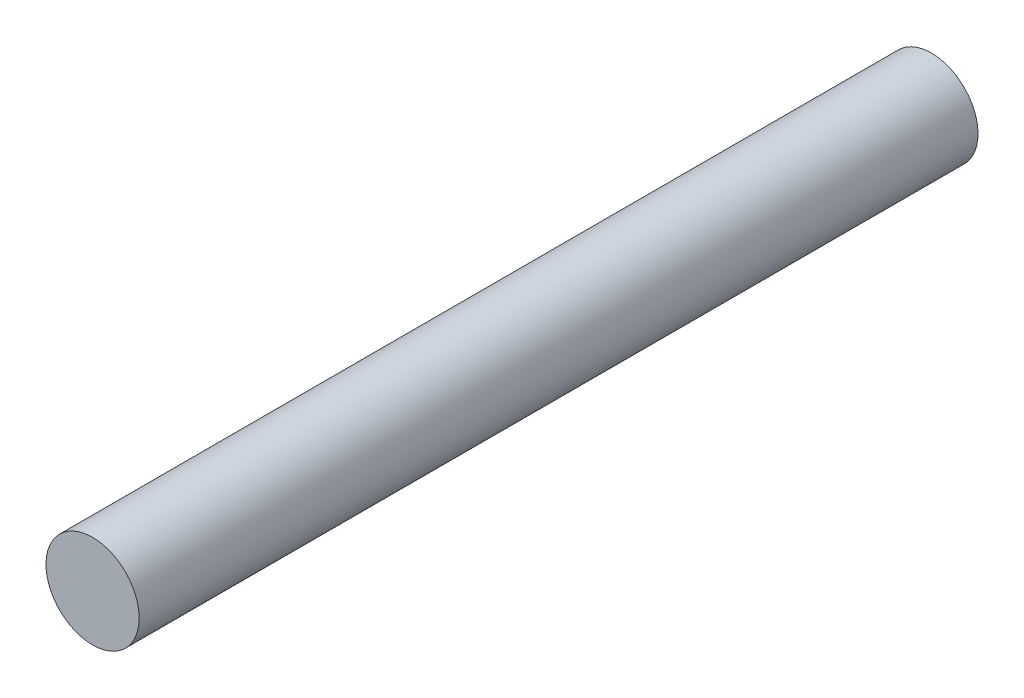
ISO-10303-21;
HEADER;
FILE_DESCRIPTION(('STEP AP214'),'2;1');
FILE_NAME('part.step','',(''),(''),'','','');
FILE_SCHEMA(('AUTOMOTIVE_DESIGN { 1 0 10303 214 1 1 1 1 }'));
ENDSEC;
DATA;
#1=APPLICATION_CONTEXT('core data for automotive mechanical design processes');
#2=APPLICATION_PROTOCOL_DEFINITION('international standard','automotive_design',2000,#1);
#3=PRODUCT_CONTEXT('',#1,'mechanical');
#4=PRODUCT('Part','Part','',(#3));
#5=PRODUCT_RELATED_PRODUCT_CATEGORY('part','',(#4));
#6=PRODUCT_DEFINITION_FORMATION('','',#4);
#7=PRODUCT_DEFINITION_CONTEXT('part definition',#1,'design');
#8=PRODUCT_DEFINITION('design','',#6,#7);
#9=PRODUCT_DEFINITION_SHAPE('','',#8);
#10=(LENGTH_UNIT() NAMED_UNIT(*) SI_UNIT(.MILLI.,.METRE.));
#11=(NAMED_UNIT(*) PLANE_ANGLE_UNIT() SI_UNIT($,.RADIAN.));
#12=(NAMED_UNIT(*) SI_UNIT($,.STERADIAN.) SOLID_ANGLE_UNIT());
#13=UNCERTAINTY_MEASURE_WITH_UNIT(LENGTH_MEASURE(1.E-05),#10,'distance_accuracy_value','');
#14=(GEOMETRIC_REPRESENTATION_CONTEXT(3) GLOBAL_UNCERTAINTY_ASSIGNED_CONTEXT((#13)) GLOBAL_UNIT_ASSIGNED_CONTEXT((#10,
#11,#12)) REPRESENTATION_CONTEXT('',''));
#15=CARTESIAN_POINT('',(0.,0.,0.));
#16=DIRECTION('',(0.,0.,1.));
#17=DIRECTION('',(1.,0.,0.));
#18=AXIS2_PLACEMENT_3D('',#15,#16,#17);
#19=CARTESIAN_POINT('',(0.,0.,45.));
#20=DIRECTION('',(0.,0.,-1.));
#21=DIRECTION('',(0.,1.,0.));
#22=AXIS2_PLACEMENT_3D('',#19,#20,#21);
#23=PLANE('',#22);
#24=CARTESIAN_POINT('',(0.,0.,45.));
#25=DIRECTION('',(0.,0.,1.));
#26=DIRECTION('',(0.,-1.,0.));
#27=AXIS2_PLACEMENT_3D('',#24,#25,#26);
#28=CIRCLE('',#27,5.);
#29=CARTESIAN_POINT('',(0.,-5.,45.));
#30=VERTEX_POINT('',#29);
#31=EDGE_CURVE('E41',#30,#30,#28,.T.);
#32=ORIENTED_EDGE('',*,*,#31,.T.);
#33=EDGE_LOOP('',(#32));
#34=FACE_BOUND('',#33,.T.);
#35=ADVANCED_FACE('F35',(#34),#23,.F.);
#36=CARTESIAN_POINT('',(0.,0.,-45.));
#37=DIRECTION('',(0.,0.,-1.));
#38=DIRECTION('',(0.,1.,0.));
#39=AXIS2_PLACEMENT_3D('',#36,#37,#38);
#40=PLANE('',#39);
#41=CARTESIAN_POINT('',(0.,0.,-45.));
#42=DIRECTION('',(0.,0.,1.));
#43=DIRECTION('',(0.,-1.,0.));
#44=AXIS2_PLACEMENT_3D('',#41,#42,#43);
#45=CIRCLE('',#44,5.);
#46=CARTESIAN_POINT('',(0.,-4.99999999999998,-45.));
#47=VERTEX_POINT('',#46);
#48=EDGE_CURVE('E10',#47,#47,#45,.T.);
#49=ORIENTED_EDGE('',*,*,#48,.F.);
#50=EDGE_LOOP('',(#49));
#51=FACE_BOUND('',#50,.T.);
#52=ADVANCED_FACE('F50',(#51),#40,.T.);
#53=CARTESIAN_POINT('',(0.,0.,45.));
#54=DIRECTION('',(0.,0.,1.));
#55=DIRECTION('',(0.,-1.,0.));
#56=AXIS2_PLACEMENT_3D('',#53,#54,#55);
#57=CYLINDRICAL_SURFACE('',#56,5.);
#58=ORIENTED_EDGE('',*,*,#48,.T.);
#59=EDGE_LOOP('',(#58));
#60=FACE_BOUND('',#59,.T.);
#61=ORIENTED_EDGE('',*,*,#31,.F.);
#62=EDGE_LOOP('',(#61));
#63=FACE_BOUND('',#62,.T.);
#64=ADVANCED_FACE('F48',(#60,#63),#57,.T.);
#65=CLOSED_SHELL('',(#35,#52,#64));
#66=MANIFOLD_SOLID_BREP('B2',#65);
#67=ADVANCED_BREP_SHAPE_REPRESENTATION('',(#18,#66),#14);
#68=SHAPE_DEFINITION_REPRESENTATION(#9,#67);
ENDSEC;
END-ISO-10303-21;
